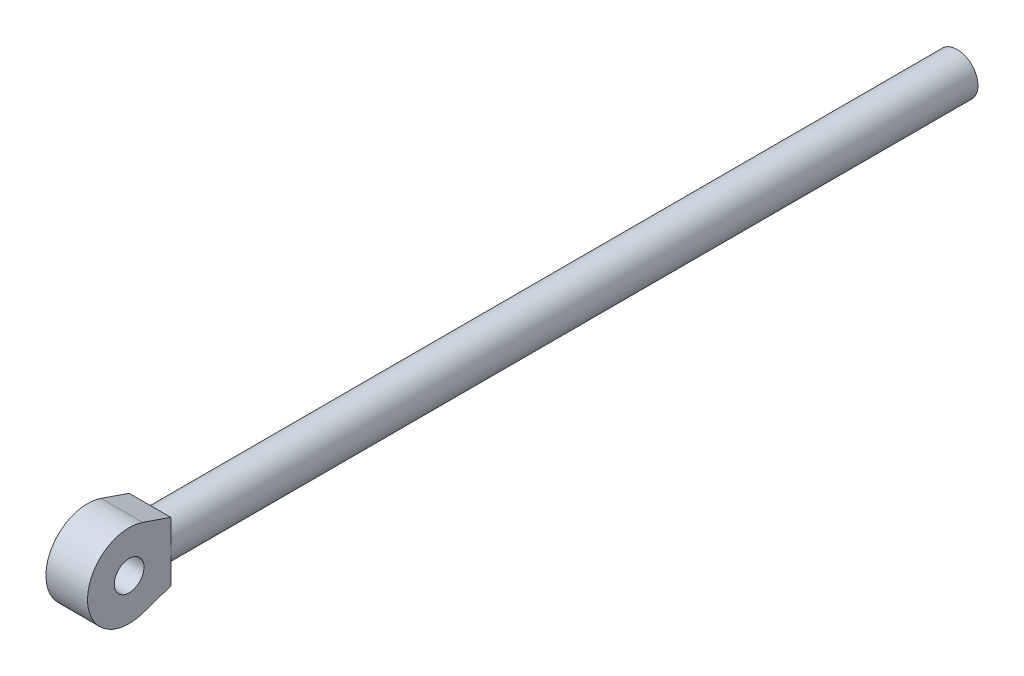
ISO-10303-21;
HEADER;
FILE_DESCRIPTION(('STEP AP214'),'2;1');
FILE_NAME('part.step','',(''),(''),'','','');
FILE_SCHEMA(('AUTOMOTIVE_DESIGN { 1 0 10303 214 1 1 1 1 }'));
ENDSEC;
DATA;
#1=APPLICATION_CONTEXT('core data for automotive mechanical design processes');
#2=APPLICATION_PROTOCOL_DEFINITION('international standard','automotive_design',2000,#1);
#3=PRODUCT_CONTEXT('',#1,'mechanical');
#4=PRODUCT('Part','Part','',(#3));
#5=PRODUCT_RELATED_PRODUCT_CATEGORY('part','',(#4));
#6=PRODUCT_DEFINITION_FORMATION('','',#4);
#7=PRODUCT_DEFINITION_CONTEXT('part definition',#1,'design');
#8=PRODUCT_DEFINITION('design','',#6,#7);
#9=PRODUCT_DEFINITION_SHAPE('','',#8);
#10=(LENGTH_UNIT() NAMED_UNIT(*) SI_UNIT(.MILLI.,.METRE.));
#11=(NAMED_UNIT(*) PLANE_ANGLE_UNIT() SI_UNIT($,.RADIAN.));
#12=(NAMED_UNIT(*) SI_UNIT($,.STERADIAN.) SOLID_ANGLE_UNIT());
#13=UNCERTAINTY_MEASURE_WITH_UNIT(LENGTH_MEASURE(1.E-05),#10,'distance_accuracy_value','');
#14=(GEOMETRIC_REPRESENTATION_CONTEXT(3) GLOBAL_UNCERTAINTY_ASSIGNED_CONTEXT((#13)) GLOBAL_UNIT_ASSIGNED_CONTEXT((#10,
#11,#12)) REPRESENTATION_CONTEXT('',''));
#15=CARTESIAN_POINT('',(0.,0.,0.));
#16=DIRECTION('',(0.,0.,1.));
#17=DIRECTION('',(1.,0.,0.));
#18=AXIS2_PLACEMENT_3D('',#15,#16,#17);
#19=CARTESIAN_POINT('',(0.,0.,679.));
#20=DIRECTION('',(0.,0.,-1.));
#21=DIRECTION('',(-1.,0.,0.));
#22=AXIS2_PLACEMENT_3D('',#19,#20,#21);
#23=CYLINDRICAL_SURFACE('',#22,17.5);
#24=CARTESIAN_POINT('',(0.,0.,679.));
#25=DIRECTION('',(0.,0.,1.));
#26=DIRECTION('',(1.,0.,0.));
#27=AXIS2_PLACEMENT_3D('',#24,#25,#26);
#28=CIRCLE('',#27,17.5);
#29=CARTESIAN_POINT('',(17.5,0.,679.));
#30=VERTEX_POINT('',#29);
#31=CARTESIAN_POINT('',(-17.5,-1.6630703532421E-13,679.));
#32=VERTEX_POINT('',#31);
#33=EDGE_CURVE('E11',#30,#32,#28,.T.);
#34=ORIENTED_EDGE('',*,*,#33,.F.);
#35=EDGE_CURVE('E43',#32,#30,#28,.T.);
#36=ORIENTED_EDGE('',*,*,#35,.F.);
#37=EDGE_LOOP('',(#34,#36));
#38=FACE_BOUND('',#37,.T.);
#39=CARTESIAN_POINT('',(0.,0.,0.));
#40=DIRECTION('',(0.,0.,1.));
#41=DIRECTION('',(1.,0.,0.));
#42=AXIS2_PLACEMENT_3D('',#39,#40,#41);
#43=CIRCLE('',#42,17.5);
#44=CARTESIAN_POINT('',(17.5,0.,0.));
#45=VERTEX_POINT('',#44);
#46=EDGE_CURVE('E37',#45,#45,#43,.T.);
#47=ORIENTED_EDGE('',*,*,#46,.T.);
#48=EDGE_LOOP('',(#47));
#49=FACE_BOUND('',#48,.T.);
#50=ADVANCED_FACE('F34',(#38,#49),#23,.T.);
#51=CARTESIAN_POINT('',(0.,0.,0.));
#52=DIRECTION('',(0.,0.,1.));
#53=DIRECTION('',(1.,0.,0.));
#54=AXIS2_PLACEMENT_3D('',#51,#52,#53);
#55=PLANE('',#54);
#56=ORIENTED_EDGE('',*,*,#46,.F.);
#57=EDGE_LOOP('',(#56));
#58=FACE_BOUND('',#57,.T.);
#59=ADVANCED_FACE('F155',(#58),#55,.F.);
#60=CARTESIAN_POINT('',(17.5,0.,679.));
#61=DIRECTION('',(0.,0.,1.));
#62=DIRECTION('',(1.,0.,0.));
#63=AXIS2_PLACEMENT_3D('',#60,#61,#62);
#64=PLANE('',#63);
#65=DIRECTION('',(0.,1.,0.));
#66=VECTOR('',#65,1.);
#67=CARTESIAN_POINT('',(17.5,0.,679.));
#68=LINE('',#67,#66);
#69=CARTESIAN_POINT('',(17.5,25.,679.));
#70=VERTEX_POINT('',#69);
#71=EDGE_CURVE('E50',#30,#70,#68,.T.);
#72=ORIENTED_EDGE('',*,*,#71,.F.);
#73=ORIENTED_EDGE('',*,*,#33,.T.);
#74=DIRECTION('',(0.,1.,0.));
#75=VECTOR('',#74,1.);
#76=CARTESIAN_POINT('',(-17.5,0.,679.));
#77=LINE('',#76,#75);
#78=CARTESIAN_POINT('',(-17.5,25.,679.));
#79=VERTEX_POINT('',#78);
#80=EDGE_CURVE('E104',#32,#79,#77,.T.);
#81=ORIENTED_EDGE('',*,*,#80,.T.);
#82=DIRECTION('',(-1.,0.,0.));
#83=VECTOR('',#82,1.);
#84=CARTESIAN_POINT('',(17.5,25.,679.));
#85=LINE('',#84,#83);
#86=EDGE_CURVE('E89',#70,#79,#85,.T.);
#87=ORIENTED_EDGE('',*,*,#86,.F.);
#88=EDGE_LOOP('',(#72,#73,#81,#87));
#89=FACE_BOUND('',#88,.T.);
#90=ADVANCED_FACE('F103',(#89),#64,.F.);
#91=CARTESIAN_POINT('',(17.5,25.,679.));
#92=DIRECTION('',(0.,-0.945945945945946,0.324324324324323));
#93=DIRECTION('',(0.,-0.324324324324323,-0.945945945945946));
#94=AXIS2_PLACEMENT_3D('',#91,#92,#93);
#95=PLANE('',#94);
#96=DIRECTION('',(0.,0.324324324324323,0.945945945945946));
#97=VECTOR('',#96,1.);
#98=CARTESIAN_POINT('',(-17.5,25.,679.));
#99=LINE('',#98,#97);
#100=CARTESIAN_POINT('',(-17.5,33.1081081081081,702.648648648649));
#101=VERTEX_POINT('',#100);
#102=EDGE_CURVE('E63',#79,#101,#99,.T.);
#103=ORIENTED_EDGE('',*,*,#102,.T.);
#104=DIRECTION('',(-1.,0.,0.));
#105=VECTOR('',#104,1.);
#106=CARTESIAN_POINT('',(17.5,33.1081081081081,702.648648648649));
#107=LINE('',#106,#105);
#108=CARTESIAN_POINT('',(17.5,33.1081081081081,702.648648648649));
#109=VERTEX_POINT('',#108);
#110=EDGE_CURVE('E92',#109,#101,#107,.T.);
#111=ORIENTED_EDGE('',*,*,#110,.F.);
#112=DIRECTION('',(0.,0.324324324324323,0.945945945945946));
#113=VECTOR('',#112,1.);
#114=CARTESIAN_POINT('',(17.5,25.,679.));
#115=LINE('',#114,#113);
#116=EDGE_CURVE('E87',#70,#109,#115,.T.);
#117=ORIENTED_EDGE('',*,*,#116,.F.);
#118=ORIENTED_EDGE('',*,*,#86,.T.);
#119=EDGE_LOOP('',(#103,#111,#117,#118));
#120=FACE_BOUND('',#119,.T.);
#121=ADVANCED_FACE('F88',(#120),#95,.F.);
#122=CARTESIAN_POINT('',(17.5,0.,714.));
#123=DIRECTION('',(-1.,0.,0.));
#124=DIRECTION('',(0.,0.,1.));
#125=AXIS2_PLACEMENT_3D('',#122,#123,#124);
#126=CYLINDRICAL_SURFACE('',#125,35.);
#127=CARTESIAN_POINT('',(-17.5,0.,714.));
#128=DIRECTION('',(1.,0.,0.));
#129=DIRECTION('',(0.,0.,-1.));
#130=AXIS2_PLACEMENT_3D('',#127,#128,#129);
#131=CIRCLE('',#130,35.);
#132=CARTESIAN_POINT('',(-17.5,-33.1081081081083,702.648648648649));
#133=VERTEX_POINT('',#132);
#134=EDGE_CURVE('E101',#101,#133,#131,.T.);
#135=ORIENTED_EDGE('',*,*,#134,.T.);
#136=DIRECTION('',(-1.,0.,0.));
#137=VECTOR('',#136,1.);
#138=CARTESIAN_POINT('',(17.5,-33.1081081081083,702.648648648649));
#139=LINE('',#138,#137);
#140=CARTESIAN_POINT('',(17.5,-33.1081081081083,702.648648648649));
#141=VERTEX_POINT('',#140);
#142=EDGE_CURVE('E112',#141,#133,#139,.T.);
#143=ORIENTED_EDGE('',*,*,#142,.F.);
#144=CARTESIAN_POINT('',(17.5,0.,714.));
#145=DIRECTION('',(1.,0.,0.));
#146=DIRECTION('',(0.,0.,-1.));
#147=AXIS2_PLACEMENT_3D('',#144,#145,#146);
#148=CIRCLE('',#147,35.);
#149=EDGE_CURVE('E95',#109,#141,#148,.T.);
#150=ORIENTED_EDGE('',*,*,#149,.F.);
#151=ORIENTED_EDGE('',*,*,#110,.T.);
#152=EDGE_LOOP('',(#135,#143,#150,#151));
#153=FACE_BOUND('',#152,.T.);
#154=ADVANCED_FACE('F143',(#153),#126,.T.);
#155=CARTESIAN_POINT('',(17.5,0.,714.));
#156=DIRECTION('',(1.,0.,0.));
#157=DIRECTION('',(0.,0.,-1.));
#158=AXIS2_PLACEMENT_3D('',#155,#156,#157);
#159=PLANE('',#158);
#160=CARTESIAN_POINT('',(17.5,0.,714.));
#161=DIRECTION('',(1.,0.,0.));
#162=DIRECTION('',(0.,0.,-1.));
#163=AXIS2_PLACEMENT_3D('',#160,#161,#162);
#164=CIRCLE('',#163,12.5);
#165=CARTESIAN_POINT('',(17.5,0.,701.5));
#166=VERTEX_POINT('',#165);
#167=EDGE_CURVE('E127',#166,#166,#164,.T.);
#168=ORIENTED_EDGE('',*,*,#167,.F.);
#169=EDGE_LOOP('',(#168));
#170=FACE_BOUND('',#169,.T.);
#171=ORIENTED_EDGE('',*,*,#71,.T.);
#172=ORIENTED_EDGE('',*,*,#116,.T.);
#173=ORIENTED_EDGE('',*,*,#149,.T.);
#174=DIRECTION('',(0.,-0.324324324324324,0.945945945945946));
#175=VECTOR('',#174,1.);
#176=CARTESIAN_POINT('',(17.5,-25.0000000000002,679.));
#177=LINE('',#176,#175);
#178=CARTESIAN_POINT('',(17.5,-25.0000000000002,679.));
#179=VERTEX_POINT('',#178);
#180=EDGE_CURVE('E117',#179,#141,#177,.T.);
#181=ORIENTED_EDGE('',*,*,#180,.F.);
#182=DIRECTION('',(0.,-1.,0.));
#183=VECTOR('',#182,1.);
#184=CARTESIAN_POINT('',(17.5,-1.6630703532421E-13,679.));
#185=LINE('',#184,#183);
#186=EDGE_CURVE('E100',#30,#179,#185,.T.);
#187=ORIENTED_EDGE('',*,*,#186,.F.);
#188=EDGE_LOOP('',(#171,#172,#173,#181,#187));
#189=FACE_BOUND('',#188,.T.);
#190=ADVANCED_FACE('F98',(#170,#189),#159,.T.);
#191=CARTESIAN_POINT('',(-17.5,0.,714.));
#192=DIRECTION('',(1.,0.,0.));
#193=DIRECTION('',(0.,0.,-1.));
#194=AXIS2_PLACEMENT_3D('',#191,#192,#193);
#195=PLANE('',#194);
#196=CARTESIAN_POINT('',(-17.5,0.,714.));
#197=DIRECTION('',(1.,0.,0.));
#198=DIRECTION('',(0.,0.,-1.));
#199=AXIS2_PLACEMENT_3D('',#196,#197,#198);
#200=CIRCLE('',#199,12.5);
#201=CARTESIAN_POINT('',(-17.5,0.,701.5));
#202=VERTEX_POINT('',#201);
#203=EDGE_CURVE('E124',#202,#202,#200,.T.);
#204=ORIENTED_EDGE('',*,*,#203,.T.);
#205=EDGE_LOOP('',(#204));
#206=FACE_BOUND('',#205,.T.);
#207=ORIENTED_EDGE('',*,*,#80,.F.);
#208=DIRECTION('',(0.,-1.,0.));
#209=VECTOR('',#208,1.);
#210=CARTESIAN_POINT('',(-17.5,-1.6630703532421E-13,679.));
#211=LINE('',#210,#209);
#212=CARTESIAN_POINT('',(-17.5,-25.0000000000002,679.));
#213=VERTEX_POINT('',#212);
#214=EDGE_CURVE('E121',#32,#213,#211,.T.);
#215=ORIENTED_EDGE('',*,*,#214,.T.);
#216=DIRECTION('',(0.,-0.324324324324324,0.945945945945946));
#217=VECTOR('',#216,1.);
#218=CARTESIAN_POINT('',(-17.5,-25.0000000000002,679.));
#219=LINE('',#218,#217);
#220=EDGE_CURVE('E118',#213,#133,#219,.T.);
#221=ORIENTED_EDGE('',*,*,#220,.T.);
#222=ORIENTED_EDGE('',*,*,#134,.F.);
#223=ORIENTED_EDGE('',*,*,#102,.F.);
#224=EDGE_LOOP('',(#207,#215,#221,#222,#223));
#225=FACE_BOUND('',#224,.T.);
#226=ADVANCED_FACE('F133',(#206,#225),#195,.F.);
#227=CARTESIAN_POINT('',(17.5,-1.6630703532421E-13,679.));
#228=DIRECTION('',(0.,0.,-1.));
#229=DIRECTION('',(0.,1.,0.));
#230=AXIS2_PLACEMENT_3D('',#227,#228,#229);
#231=PLANE('',#230);
#232=ORIENTED_EDGE('',*,*,#35,.T.);
#233=ORIENTED_EDGE('',*,*,#186,.T.);
#234=DIRECTION('',(-1.,0.,0.));
#235=VECTOR('',#234,1.);
#236=CARTESIAN_POINT('',(17.5,-25.0000000000002,679.));
#237=LINE('',#236,#235);
#238=EDGE_CURVE('E72',#179,#213,#237,.T.);
#239=ORIENTED_EDGE('',*,*,#238,.T.);
#240=ORIENTED_EDGE('',*,*,#214,.F.);
#241=EDGE_LOOP('',(#232,#233,#239,#240));
#242=FACE_BOUND('',#241,.T.);
#243=ADVANCED_FACE('F149',(#242),#231,.T.);
#244=CARTESIAN_POINT('',(17.5,-25.0000000000002,679.));
#245=DIRECTION('',(0.,-0.945945945945946,-0.324324324324324));
#246=DIRECTION('',(0.,0.324324324324324,-0.945945945945946));
#247=AXIS2_PLACEMENT_3D('',#244,#245,#246);
#248=PLANE('',#247);
#249=ORIENTED_EDGE('',*,*,#220,.F.);
#250=ORIENTED_EDGE('',*,*,#238,.F.);
#251=ORIENTED_EDGE('',*,*,#180,.T.);
#252=ORIENTED_EDGE('',*,*,#142,.T.);
#253=EDGE_LOOP('',(#249,#250,#251,#252));
#254=FACE_BOUND('',#253,.T.);
#255=ADVANCED_FACE('F138',(#254),#248,.T.);
#256=CARTESIAN_POINT('',(-17.5,0.,714.));
#257=DIRECTION('',(1.,0.,0.));
#258=DIRECTION('',(0.,0.,-1.));
#259=AXIS2_PLACEMENT_3D('',#256,#257,#258);
#260=CYLINDRICAL_SURFACE('',#259,12.5);
#261=ORIENTED_EDGE('',*,*,#203,.F.);
#262=EDGE_LOOP('',(#261));
#263=FACE_BOUND('',#262,.T.);
#264=ORIENTED_EDGE('',*,*,#167,.T.);
#265=EDGE_LOOP('',(#264));
#266=FACE_BOUND('',#265,.T.);
#267=ADVANCED_FACE('F135',(#263,#266),#260,.F.);
#268=CLOSED_SHELL('',(#50,#59,#90,#121,#154,#190,#226,#243,#255,#267));
#269=MANIFOLD_SOLID_BREP('B2',#268);
#270=ADVANCED_BREP_SHAPE_REPRESENTATION('',(#18,#269),#14);
#271=SHAPE_DEFINITION_REPRESENTATION(#9,#270);
ENDSEC;
END-ISO-10303-21;
